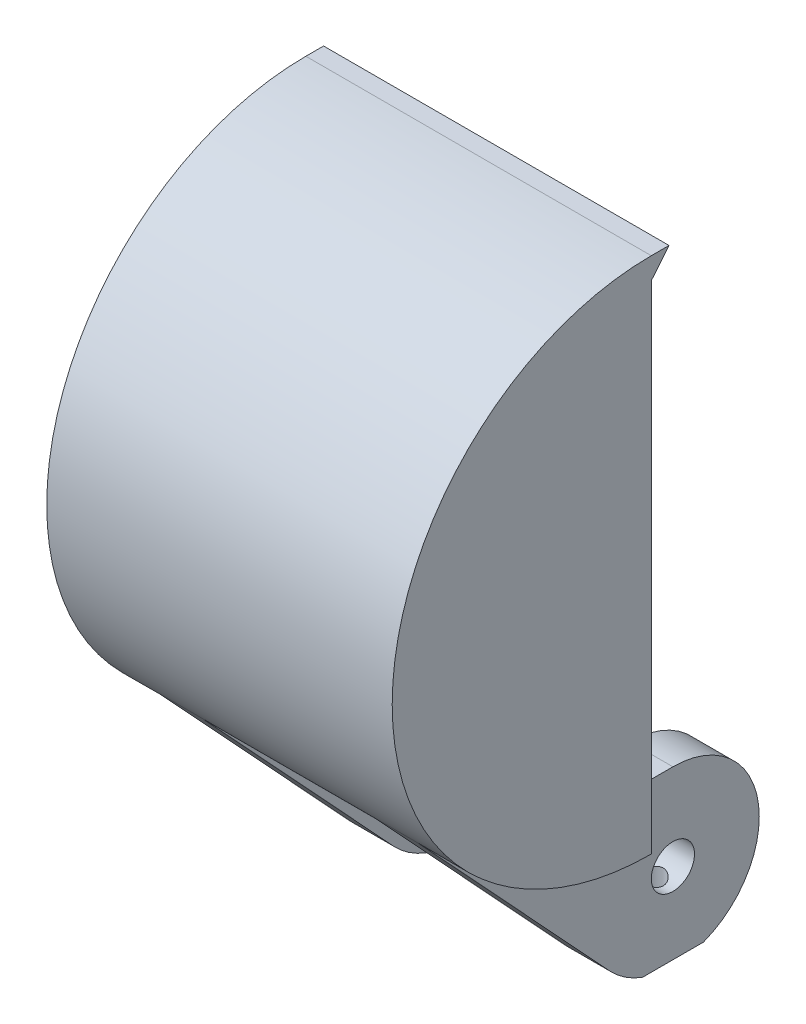
ISO-10303-21;
HEADER;
FILE_DESCRIPTION(('STEP AP214'),'2;1');
FILE_NAME('part.step','',(''),(''),'','','');
FILE_SCHEMA(('AUTOMOTIVE_DESIGN { 1 0 10303 214 1 1 1 1 }'));
ENDSEC;
DATA;
#1=APPLICATION_CONTEXT('core data for automotive mechanical design processes');
#2=APPLICATION_PROTOCOL_DEFINITION('international standard','automotive_design',2000,#1);
#3=PRODUCT_CONTEXT('',#1,'mechanical');
#4=PRODUCT('Part','Part','',(#3));
#5=PRODUCT_RELATED_PRODUCT_CATEGORY('part','',(#4));
#6=PRODUCT_DEFINITION_FORMATION('','',#4);
#7=PRODUCT_DEFINITION_CONTEXT('part definition',#1,'design');
#8=PRODUCT_DEFINITION('design','',#6,#7);
#9=PRODUCT_DEFINITION_SHAPE('','',#8);
#10=(LENGTH_UNIT() NAMED_UNIT(*) SI_UNIT(.MILLI.,.METRE.));
#11=(NAMED_UNIT(*) PLANE_ANGLE_UNIT() SI_UNIT($,.RADIAN.));
#12=(NAMED_UNIT(*) SI_UNIT($,.STERADIAN.) SOLID_ANGLE_UNIT());
#13=UNCERTAINTY_MEASURE_WITH_UNIT(LENGTH_MEASURE(1.E-05),#10,'distance_accuracy_value','');
#14=(GEOMETRIC_REPRESENTATION_CONTEXT(3) GLOBAL_UNCERTAINTY_ASSIGNED_CONTEXT((#13)) GLOBAL_UNIT_ASSIGNED_CONTEXT((#10,
#11,#12)) REPRESENTATION_CONTEXT('',''));
#15=CARTESIAN_POINT('',(0.,0.,0.));
#16=DIRECTION('',(0.,0.,1.));
#17=DIRECTION('',(1.,0.,0.));
#18=AXIS2_PLACEMENT_3D('',#15,#16,#17);
#19=CARTESIAN_POINT('',(19.05,-9.525,-9.5249999999999));
#20=DIRECTION('',(-1.,0.,0.));
#21=DIRECTION('',(0.,0.,1.));
#22=AXIS2_PLACEMENT_3D('',#19,#20,#21);
#23=CYLINDRICAL_SURFACE('',#22,12.7);
#24=CARTESIAN_POINT('',(-12.7,-9.525,-9.5249999999999));
#25=DIRECTION('',(1.,0.,0.));
#26=DIRECTION('',(0.,0.,-1.));
#27=AXIS2_PLACEMENT_3D('',#24,#25,#26);
#28=CIRCLE('',#27,12.7);
#29=CARTESIAN_POINT('',(-12.7,-21.4047622030073,-14.0151280605345));
#30=VERTEX_POINT('',#29);
#31=CARTESIAN_POINT('',(-12.7,3.17499999999999,-9.5249999999999));
#32=VERTEX_POINT('',#31);
#33=EDGE_CURVE('E284',#30,#32,#28,.T.);
#34=ORIENTED_EDGE('',*,*,#33,.F.);
#35=DIRECTION('',(-1.,0.,0.));
#36=VECTOR('',#35,1.);
#37=CARTESIAN_POINT('',(19.05,-21.4047622030073,-14.0151280605345));
#38=LINE('',#37,#36);
#39=CARTESIAN_POINT('',(-19.05,-21.4047622030073,-14.0151280605345));
#40=VERTEX_POINT('',#39);
#41=EDGE_CURVE('E59',#30,#40,#38,.T.);
#42=ORIENTED_EDGE('',*,*,#41,.T.);
#43=CARTESIAN_POINT('',(-19.05,-9.525,-9.5249999999999));
#44=DIRECTION('',(1.,0.,0.));
#45=DIRECTION('',(0.,0.,-1.));
#46=AXIS2_PLACEMENT_3D('',#43,#44,#45);
#47=CIRCLE('',#46,12.7);
#48=CARTESIAN_POINT('',(-19.05,3.17499999999999,-9.52499999999991));
#49=VERTEX_POINT('',#48);
#50=EDGE_CURVE('E232',#40,#49,#47,.T.);
#51=ORIENTED_EDGE('',*,*,#50,.T.);
#52=DIRECTION('',(-1.,0.,0.));
#53=VECTOR('',#52,1.);
#54=CARTESIAN_POINT('',(19.05,3.17499999999999,-9.5249999999999));
#55=LINE('',#54,#53);
#56=EDGE_CURVE('E240',#32,#49,#55,.T.);
#57=ORIENTED_EDGE('',*,*,#56,.F.);
#58=EDGE_LOOP('',(#34,#42,#51,#57));
#59=FACE_BOUND('',#58,.T.);
#60=ADVANCED_FACE('F41',(#59),#23,.T.);
#61=DIRECTION('',(-1.,0.,0.));
#62=VECTOR('',#61,1.);
#63=CARTESIAN_POINT('',(19.05,-21.4047622030073,-5.03487193946534));
#64=LINE('',#63,#62);
#65=CARTESIAN_POINT('',(19.05,-21.4047622030073,-5.03487193946534));
#66=VERTEX_POINT('',#65);
#67=CARTESIAN_POINT('',(12.7,-21.4047622030073,-5.03487193946534));
#68=VERTEX_POINT('',#67);
#69=EDGE_CURVE('E67',#66,#68,#64,.T.);
#70=ORIENTED_EDGE('',*,*,#69,.F.);
#71=CARTESIAN_POINT('',(19.05,-9.525,-9.5249999999999));
#72=DIRECTION('',(1.,0.,0.));
#73=DIRECTION('',(0.,0.,-1.));
#74=AXIS2_PLACEMENT_3D('',#71,#72,#73);
#75=CIRCLE('',#74,12.7);
#76=CARTESIAN_POINT('',(19.05,-18.1607402704121,-0.212965314605844));
#77=VERTEX_POINT('',#76);
#78=EDGE_CURVE('E206',#77,#66,#75,.T.);
#79=ORIENTED_EDGE('',*,*,#78,.F.);
#80=DIRECTION('',(1.,0.,0.));
#81=VECTOR('',#80,1.);
#82=CARTESIAN_POINT('',(-67.3789528206499,-18.1607402704121,-0.212965314605844));
#83=LINE('',#82,#81);
#84=CARTESIAN_POINT('',(12.7,-18.1607402704121,-0.212965314605844));
#85=VERTEX_POINT('',#84);
#86=EDGE_CURVE('E548',#85,#77,#83,.T.);
#87=ORIENTED_EDGE('',*,*,#86,.F.);
#88=CARTESIAN_POINT('',(12.7,-9.525,-9.5249999999999));
#89=DIRECTION('',(1.,0.,0.));
#90=DIRECTION('',(0.,0.,-1.));
#91=AXIS2_PLACEMENT_3D('',#88,#89,#90);
#92=CIRCLE('',#91,12.7);
#93=EDGE_CURVE('E208',#85,#68,#92,.T.);
#94=ORIENTED_EDGE('',*,*,#93,.T.);
#95=EDGE_LOOP('',(#70,#79,#87,#94));
#96=FACE_BOUND('',#95,.T.);
#97=ADVANCED_FACE('F204',(#96),#23,.T.);
#98=DIRECTION('',(-1.,0.,0.));
#99=VECTOR('',#98,1.);
#100=CARTESIAN_POINT('',(19.05,-21.4047622030073,-14.0151280605345));
#101=LINE('',#100,#99);
#102=CARTESIAN_POINT('',(12.7,-21.4047622030073,-14.0151280605345));
#103=VERTEX_POINT('',#102);
#104=CARTESIAN_POINT('',(19.05,-21.4047622030073,-14.0151280605345));
#105=VERTEX_POINT('',#104);
#106=EDGE_CURVE('E193',#103,#105,#101,.F.);
#107=ORIENTED_EDGE('',*,*,#106,.F.);
#108=CARTESIAN_POINT('',(12.7,3.17499999999999,-9.5249999999999));
#109=VERTEX_POINT('',#108);
#110=EDGE_CURVE('E564',#103,#109,#92,.T.);
#111=ORIENTED_EDGE('',*,*,#110,.T.);
#112=CARTESIAN_POINT('',(19.05,3.17499999999999,-9.5249999999999));
#113=VERTEX_POINT('',#112);
#114=EDGE_CURVE('E245',#113,#109,#55,.T.);
#115=ORIENTED_EDGE('',*,*,#114,.F.);
#116=EDGE_CURVE('E218',#105,#113,#75,.T.);
#117=ORIENTED_EDGE('',*,*,#116,.F.);
#118=EDGE_LOOP('',(#107,#111,#115,#117));
#119=FACE_BOUND('',#118,.T.);
#120=ADVANCED_FACE('F407',(#119),#23,.T.);
#121=CARTESIAN_POINT('',(19.05,-9.525,-9.5249999999999));
#122=DIRECTION('',(1.,0.,0.));
#123=DIRECTION('',(0.,0.,-1.));
#124=AXIS2_PLACEMENT_3D('',#121,#122,#123);
#125=PLANE('',#124);
#126=CARTESIAN_POINT('',(19.05,-9.525,-9.5249999999999));
#127=DIRECTION('',(1.,0.,0.));
#128=DIRECTION('',(0.,0.,-1.));
#129=AXIS2_PLACEMENT_3D('',#126,#127,#128);
#130=CIRCLE('',#129,3.175);
#131=CARTESIAN_POINT('',(19.05,-9.525,-12.6999999999999));
#132=VERTEX_POINT('',#131);
#133=EDGE_CURVE('E295',#132,#132,#130,.F.);
#134=ORIENTED_EDGE('',*,*,#133,.T.);
#135=EDGE_LOOP('',(#134));
#136=FACE_BOUND('',#135,.T.);
#137=ORIENTED_EDGE('',*,*,#78,.T.);
#138=DIRECTION('',(0.,0.,-1.));
#139=VECTOR('',#138,1.);
#140=CARTESIAN_POINT('',(19.05,-21.4047622030073,-15.8749999999999));
#141=LINE('',#140,#139);
#142=EDGE_CURVE('E190',#66,#105,#141,.T.);
#143=ORIENTED_EDGE('',*,*,#142,.T.);
#144=ORIENTED_EDGE('',*,*,#116,.T.);
#145=DIRECTION('',(0.,0.,1.));
#146=VECTOR('',#145,1.);
#147=CARTESIAN_POINT('',(19.05,3.175,0.));
#148=LINE('',#147,#146);
#149=CARTESIAN_POINT('',(19.05,3.175,0.));
#150=VERTEX_POINT('',#149);
#151=EDGE_CURVE('E233',#113,#150,#148,.T.);
#152=ORIENTED_EDGE('',*,*,#151,.T.);
#153=DIRECTION('',(0.,-1.,0.));
#154=VECTOR('',#153,1.);
#155=CARTESIAN_POINT('',(19.05,3.175,0.));
#156=LINE('',#155,#154);
#157=CARTESIAN_POINT('',(19.05,0.,0.));
#158=VERTEX_POINT('',#157);
#159=EDGE_CURVE('E237',#150,#158,#156,.T.);
#160=ORIENTED_EDGE('',*,*,#159,.T.);
#161=CARTESIAN_POINT('',(19.05,38.1,0.));
#162=DIRECTION('',(1.,0.,0.));
#163=DIRECTION('',(0.,0.,-1.));
#164=AXIS2_PLACEMENT_3D('',#161,#162,#163);
#165=CIRCLE('',#164,38.1);
#166=CARTESIAN_POINT('',(19.05,12.1927791887636,27.9361040561822));
#167=VERTEX_POINT('',#166);
#168=EDGE_CURVE('E540',#167,#158,#165,.T.);
#169=ORIENTED_EDGE('',*,*,#168,.F.);
#170=DIRECTION('',(0.,-0.733231077590084,-0.679979548851349));
#171=VECTOR('',#170,1.);
#172=CARTESIAN_POINT('',(19.05,12.1927791887636,27.9361040561822));
#173=LINE('',#172,#171);
#174=EDGE_CURVE('E215',#167,#77,#173,.T.);
#175=ORIENTED_EDGE('',*,*,#174,.T.);
#176=EDGE_LOOP('',(#137,#143,#144,#152,#160,#169,#175));
#177=FACE_BOUND('',#176,.T.);
#178=ADVANCED_FACE('F212',(#136,#177),#125,.T.);
#179=CARTESIAN_POINT('',(12.7,-9.525,-9.5249999999999));
#180=DIRECTION('',(1.,0.,0.));
#181=DIRECTION('',(0.,0.,-1.));
#182=AXIS2_PLACEMENT_3D('',#179,#180,#181);
#183=PLANE('',#182);
#184=CARTESIAN_POINT('',(12.7,-9.525,-9.5249999999999));
#185=DIRECTION('',(1.,0.,0.));
#186=DIRECTION('',(0.,0.,-1.));
#187=AXIS2_PLACEMENT_3D('',#184,#185,#186);
#188=CIRCLE('',#187,3.175);
#189=CARTESIAN_POINT('',(12.7,-9.525,-12.6999999999999));
#190=VERTEX_POINT('',#189);
#191=EDGE_CURVE('E290',#190,#190,#188,.T.);
#192=ORIENTED_EDGE('',*,*,#191,.T.);
#193=EDGE_LOOP('',(#192));
#194=FACE_BOUND('',#193,.T.);
#195=DIRECTION('',(0.,0.,1.));
#196=VECTOR('',#195,1.);
#197=CARTESIAN_POINT('',(12.7,-21.4047622030073,-10.3976842566553));
#198=LINE('',#197,#196);
#199=EDGE_CURVE('E198',#103,#68,#198,.T.);
#200=ORIENTED_EDGE('',*,*,#199,.T.);
#201=ORIENTED_EDGE('',*,*,#93,.F.);
#202=DIRECTION('',(0.,-0.733231077590084,-0.679979548851349));
#203=VECTOR('',#202,1.);
#204=CARTESIAN_POINT('',(12.7,12.1927791887636,27.9361040561822));
#205=LINE('',#204,#203);
#206=CARTESIAN_POINT('',(12.7,12.1927791887636,27.9361040561822));
#207=VERTEX_POINT('',#206);
#208=EDGE_CURVE('E507',#207,#85,#205,.T.);
#209=ORIENTED_EDGE('',*,*,#208,.F.);
#210=CARTESIAN_POINT('',(12.7,38.1,0.));
#211=DIRECTION('',(-1.,0.,0.));
#212=DIRECTION('',(0.,0.,-1.));
#213=AXIS2_PLACEMENT_3D('',#210,#211,#212);
#214=CIRCLE('',#213,38.1);
#215=CARTESIAN_POINT('',(12.7,0.,0.));
#216=VERTEX_POINT('',#215);
#217=EDGE_CURVE('E525',#216,#207,#214,.T.);
#218=ORIENTED_EDGE('',*,*,#217,.F.);
#219=DIRECTION('',(0.,-1.,0.));
#220=VECTOR('',#219,1.);
#221=CARTESIAN_POINT('',(12.7,3.175,0.));
#222=LINE('',#221,#220);
#223=CARTESIAN_POINT('',(12.7,3.175,0.));
#224=VERTEX_POINT('',#223);
#225=EDGE_CURVE('E521',#224,#216,#222,.T.);
#226=ORIENTED_EDGE('',*,*,#225,.F.);
#227=DIRECTION('',(0.,0.,1.));
#228=VECTOR('',#227,1.);
#229=CARTESIAN_POINT('',(12.7,3.17499999999999,-9.5249999999999));
#230=LINE('',#229,#228);
#231=EDGE_CURVE('E500',#109,#224,#230,.T.);
#232=ORIENTED_EDGE('',*,*,#231,.F.);
#233=ORIENTED_EDGE('',*,*,#110,.F.);
#234=EDGE_LOOP('',(#200,#201,#209,#218,#226,#232,#233));
#235=FACE_BOUND('',#234,.T.);
#236=ADVANCED_FACE('F396',(#194,#235),#183,.F.);
#237=CARTESIAN_POINT('',(15.875,76.201,-9.5249999999999));
#238=DIRECTION('',(0.,-1.,0.));
#239=DIRECTION('',(0.,0.,-1.));
#240=AXIS2_PLACEMENT_3D('',#237,#238,#239);
#241=CYLINDRICAL_SURFACE('',#240,1.7526);
#242=CARTESIAN_POINT('',(15.875,-12.1724550496656,-11.2775999999999));
#243=CARTESIAN_POINT('',(15.9647567687844,-12.1724645583195,-11.2775932057311));
#244=CARTESIAN_POINT('',(16.0545904624648,-12.1770919527004,-11.270656874895));
#245=CARTESIAN_POINT('',(16.2313732835301,-12.1948747829699,-11.2433249380897));
#246=CARTESIAN_POINT('',(16.3183173365313,-12.208044465479,-11.2229068465438));
#247=CARTESIAN_POINT('',(16.4864084189323,-12.2408924027287,-11.1698436469183));
#248=CARTESIAN_POINT('',(16.5675881047478,-12.2605297174707,-11.137275281995));
#249=CARTESIAN_POINT('',(16.7232996676529,-12.3040335545495,-11.0610722078565));
#250=CARTESIAN_POINT('',(16.7978301212098,-12.3279009792585,-11.0174351365931));
#251=CARTESIAN_POINT('',(16.9464815816065,-12.3801292164263,-10.9151373616518));
#252=CARTESIAN_POINT('',(17.01978750351,-12.4087000877072,-10.8553990696575));
#253=CARTESIAN_POINT('',(17.1559950270638,-12.4654302207083,-10.7248195296341));
#254=CARTESIAN_POINT('',(17.218890346704,-12.4935892246236,-10.6539716276405));
#255=CARTESIAN_POINT('',(17.3378586401947,-12.5492309309299,-10.4957077133186));
#256=CARTESIAN_POINT('',(17.392867879543,-12.5764434991874,-10.4073879322698));
#257=CARTESIAN_POINT('',(17.4868673418205,-12.6242731681391,-10.2209607365159));
#258=CARTESIAN_POINT('',(17.5258698599881,-12.6448953284168,-10.1228609064251));
#259=CARTESIAN_POINT('',(17.5833106874674,-12.6756837546072,-9.92834416413666));
#260=CARTESIAN_POINT('',(17.6031964684274,-12.6865804503802,-9.83247311008537));
#261=CARTESIAN_POINT('',(17.6266696742046,-12.6994704759873,-9.63819148065581));
#262=CARTESIAN_POINT('',(17.6302695655729,-12.7014706159527,-9.53978290575991));
#263=CARTESIAN_POINT('',(17.6214789917252,-12.6966246786264,-9.35437283363614));
#264=CARTESIAN_POINT('',(17.6107347232989,-12.6906892179928,-9.26726276078522));
#265=CARTESIAN_POINT('',(17.5765972895375,-12.672101316059,-9.09631486651102));
#266=CARTESIAN_POINT('',(17.5532031515392,-12.6594483582442,-9.01247729724586));
#267=CARTESIAN_POINT('',(17.4944382491126,-12.6283807306155,-8.84925118362467));
#268=CARTESIAN_POINT('',(17.4589431028748,-12.6099063805235,-8.76991925045296));
#269=CARTESIAN_POINT('',(17.3772405545183,-12.5687641546071,-8.61818500137319));
#270=CARTESIAN_POINT('',(17.3310297477191,-12.5460949464164,-8.54578489826318));
#271=CARTESIAN_POINT('',(17.2235075829806,-12.4956892715234,-8.40157792939114));
#272=CARTESIAN_POINT('',(17.1611025549059,-12.4676698967392,-8.33068538594523));
#273=CARTESIAN_POINT('',(17.0258266949111,-12.4111118915545,-8.19982996556361));
#274=CARTESIAN_POINT('',(16.9529449908922,-12.3825727489744,-8.13987859127766));
#275=CARTESIAN_POINT('',(16.7909889660955,-12.3253247656826,-8.02728873424891));
#276=CARTESIAN_POINT('',(16.7010513038562,-12.2968261129468,-7.97577316179563));
#277=CARTESIAN_POINT('',(16.511959017779,-12.2464854609558,-7.88894382045943));
#278=CARTESIAN_POINT('',(16.4128152219245,-12.2246357676412,-7.85361130071953));
#279=CARTESIAN_POINT('',(16.2163401773019,-12.1927580505862,-7.80322097707649));
#280=CARTESIAN_POINT('',(16.119508124948,-12.1819184333054,-7.78675731583384));
#281=CARTESIAN_POINT('',(15.9238974176234,-12.1711146297793,-7.77034413298263));
#282=CARTESIAN_POINT('',(15.8251211685018,-12.171137755236,-7.77037534443508));
#283=CARTESIAN_POINT('',(15.6440385531217,-12.1811971970573,-7.7856648646544));
#284=CARTESIAN_POINT('',(15.5614445974087,-12.1897618504179,-7.7986852953054));
#285=CARTESIAN_POINT('',(15.3998477283674,-12.2135672776657,-7.8360010665742));
#286=CARTESIAN_POINT('',(15.3208464311007,-12.2288110238097,-7.86030142714959));
#287=CARTESIAN_POINT('',(15.1648173172754,-12.2649568013238,-7.92046422883784));
#288=CARTESIAN_POINT('',(15.0880103435855,-12.2860688765406,-7.95676785856972));
#289=CARTESIAN_POINT('',(14.9411177888474,-12.3314685447584,-8.03954141333379));
#290=CARTESIAN_POINT('',(14.8710355423953,-12.3557576992175,-8.08601634492685));
#291=CARTESIAN_POINT('',(14.7278381600453,-12.4094255284405,-8.19644663562287));
#292=CARTESIAN_POINT('',(14.6560284637572,-12.4389971945228,-8.26200864536626));
#293=CARTESIAN_POINT('',(14.5239033862796,-12.496690808326,-8.40446943350483));
#294=CARTESIAN_POINT('',(14.4635948749868,-12.5248118823083,-8.48137493927502));
#295=CARTESIAN_POINT('',(14.3532843358461,-12.5782257387154,-8.64944447337316));
#296=CARTESIAN_POINT('',(14.3039767512683,-12.6032969952058,-8.74114025981718));
#297=CARTESIAN_POINT('',(14.2220114702828,-12.6459227076068,-8.93329616434359));
#298=CARTESIAN_POINT('',(14.1893363673381,-12.6634850188253,-9.0337469904128));
#299=CARTESIAN_POINT('',(14.1448786601393,-12.6875986147374,-9.22951552046447));
#300=CARTESIAN_POINT('',(14.1313026872026,-12.6950914992254,-9.32430924154136));
#301=CARTESIAN_POINT('',(14.1198284437919,-12.7014159125461,-9.51511133822979));
#302=CARTESIAN_POINT('',(14.1219217794707,-12.7002520786736,-9.61111903601493));
#303=CARTESIAN_POINT('',(14.1407398084891,-12.6899056611602,-9.79239124808271));
#304=CARTESIAN_POINT('',(14.1561252727485,-12.6814571805016,-9.87784259935055));
#305=CARTESIAN_POINT('',(14.1990219186543,-12.6583042261247,-10.0447406050672));
#306=CARTESIAN_POINT('',(14.2265345370975,-12.6435990111304,-10.1261867837212));
#307=CARTESIAN_POINT('',(14.2937483962366,-12.6085896707191,-10.2859304255072));
#308=CARTESIAN_POINT('',(14.3338292808446,-12.5881135032197,-10.3640291680029));
#309=CARTESIAN_POINT('',(14.4245681351635,-12.5434783100661,-10.5126456870434));
#310=CARTESIAN_POINT('',(14.4752303439618,-12.5193178094454,-10.5831604080751));
#311=CARTESIAN_POINT('',(14.5923990849817,-12.4662656720876,-10.7232559758487));
#312=CARTESIAN_POINT('',(14.6600598508985,-12.4371499087476,-10.7917880228973));
#313=CARTESIAN_POINT('',(14.8058667733511,-12.3793970781111,-10.9170530540174));
#314=CARTESIAN_POINT('',(14.8840256538752,-12.3507606398921,-10.9737715035235));
#315=CARTESIAN_POINT('',(15.0551748343657,-12.2952235540166,-11.0774741882756));
#316=CARTESIAN_POINT('',(15.1488119712627,-12.2685729631375,-11.1235354453692));
#317=CARTESIAN_POINT('',(15.3443870200599,-12.2234506542013,-11.1986012735643));
#318=CARTESIAN_POINT('',(15.4462973957865,-12.2049530232922,-11.2276599823592));
#319=CARTESIAN_POINT('',(15.6037911141482,-12.1857806313311,-11.2573395263411));
#320=CARTESIAN_POINT('',(15.6576216486912,-12.1808138578013,-11.2649179327179));
#321=CARTESIAN_POINT('',(15.7659586709785,-12.1741482313781,-11.2750501520016));
#322=CARTESIAN_POINT('',(15.8204651367116,-12.1724492723505,-11.2776041280955));
#323=CARTESIAN_POINT('',(15.875,-12.1724550496656,-11.2775999999999));
#324=B_SPLINE_CURVE_WITH_KNOTS('',3,(#242,#243,#244,#245,#246,#247,#248,#249,#250,#251,#252,
#253,#254,#255,#256,#257,#258,#259,#260,#261,#262,#263,#264,#265,#266,#267,#268,#269,#270,#271,
#272,#273,#274,#275,#276,#277,#278,#279,#280,#281,#282,#283,#284,#285,#286,#287,#288,#289,#290,
#291,#292,#293,#294,#295,#296,#297,#298,#299,#300,#301,#302,#303,#304,#305,#306,#307,#308,#309,
#310,#311,#312,#313,#314,#315,#316,#317,#318,#319,#320,#321,#322,#323),.UNSPECIFIED.,.T.,.F.,(4,
2,2,2,2,2,2,2,2,2,2,2,2,2,2,2,2,2,2,2,2,2,2,2,2,2,2,2,2,2,2,2,2,2,2,2,2,2,2,2,4),(0.,
0.269038648864508,0.538527151572856,0.806341569744072,1.07421318733752,1.36937177088417,
1.66470781606018,1.98564049827594,2.30632619907024,2.60018222876049,2.89381327892236,
3.15648009799081,3.4191671166853,3.68463994795934,3.95019724361247,4.24452910631171,
4.53916864495985,4.8599850106659,5.18042870904633,5.47501720880937,5.76926161339844,
6.02027487179393,6.2713999469989,6.53303133187411,6.79479178885285,7.09838795026176,
7.40216489182913,7.72165444713747,8.04080895324393,8.32735840738305,8.61375437165393,
8.8742706871395,9.13481787628699,9.40414886274312,9.67358795619315,9.97415122593313,
10.2750821299158,10.5964553832114,10.916799705918,11.0802688535257,11.2437326917836),.UNSPECIFIED.);
#325=CARTESIAN_POINT('',(15.875,-12.1724550496656,-11.2775999999999));
#326=VERTEX_POINT('',#325);
#327=EDGE_CURVE('E349',#326,#326,#324,.T.);
#328=ORIENTED_EDGE('',*,*,#327,.F.);
#329=EDGE_LOOP('',(#328));
#330=FACE_BOUND('',#329,.T.);
#331=CARTESIAN_POINT('',(15.875,-21.4047622030073,-9.5249999999999));
#332=DIRECTION('',(0.,-1.,0.));
#333=DIRECTION('',(0.,0.,-1.));
#334=AXIS2_PLACEMENT_3D('',#331,#332,#333);
#335=CIRCLE('',#334,1.7526);
#336=CARTESIAN_POINT('',(15.875,-21.4047622030073,-11.2775999999999));
#337=VERTEX_POINT('',#336);
#338=EDGE_CURVE('E324',#337,#337,#335,.T.);
#339=ORIENTED_EDGE('',*,*,#338,.T.);
#340=EDGE_LOOP('',(#339));
#341=FACE_BOUND('',#340,.T.);
#342=ADVANCED_FACE('F365',(#330,#341),#241,.F.);
#343=CARTESIAN_POINT('',(-19.05,-18.1607402704121,-0.212965314605847));
#344=VERTEX_POINT('',#343);
#345=CARTESIAN_POINT('',(-19.05,-21.4047622030073,-5.03487193946534));
#346=VERTEX_POINT('',#345);
#347=EDGE_CURVE('E225',#344,#346,#47,.T.);
#348=ORIENTED_EDGE('',*,*,#347,.T.);
#349=DIRECTION('',(-1.,0.,0.));
#350=VECTOR('',#349,1.);
#351=CARTESIAN_POINT('',(19.05,-21.4047622030073,-5.03487193946534));
#352=LINE('',#351,#350);
#353=CARTESIAN_POINT('',(-12.7,-21.4047622030073,-5.03487193946534));
#354=VERTEX_POINT('',#353);
#355=EDGE_CURVE('E342',#346,#354,#352,.F.);
#356=ORIENTED_EDGE('',*,*,#355,.T.);
#357=CARTESIAN_POINT('',(-12.7,-18.1607402704121,-0.212965314605837));
#358=VERTEX_POINT('',#357);
#359=EDGE_CURVE('E285',#358,#354,#28,.T.);
#360=ORIENTED_EDGE('',*,*,#359,.F.);
#361=EDGE_CURVE('E541',#344,#358,#83,.T.);
#362=ORIENTED_EDGE('',*,*,#361,.F.);
#363=EDGE_LOOP('',(#348,#356,#360,#362));
#364=FACE_BOUND('',#363,.T.);
#365=ADVANCED_FACE('F394',(#364),#23,.T.);
#366=CARTESIAN_POINT('',(28.0302561210691,-9.525,-9.5249999999999));
#367=DIRECTION('',(-1.,0.,0.));
#368=DIRECTION('',(0.,0.,1.));
#369=AXIS2_PLACEMENT_3D('',#366,#367,#368);
#370=CYLINDRICAL_SURFACE('',#369,3.175);
#371=ORIENTED_EDGE('',*,*,#133,.F.);
#372=EDGE_LOOP('',(#371));
#373=FACE_BOUND('',#372,.T.);
#374=ORIENTED_EDGE('',*,*,#191,.F.);
#375=EDGE_LOOP('',(#374));
#376=FACE_BOUND('',#375,.T.);
#377=ORIENTED_EDGE('',*,*,#327,.T.);
#378=EDGE_LOOP('',(#377));
#379=FACE_BOUND('',#378,.T.);
#380=ADVANCED_FACE('F390',(#373,#376,#379),#370,.F.);
#381=CARTESIAN_POINT('',(-12.7,-9.525,-9.5249999999999));
#382=DIRECTION('',(1.,0.,0.));
#383=DIRECTION('',(0.,0.,-1.));
#384=AXIS2_PLACEMENT_3D('',#381,#382,#383);
#385=CIRCLE('',#384,3.175);
#386=CARTESIAN_POINT('',(-12.7,-9.525,-12.6999999999999));
#387=VERTEX_POINT('',#386);
#388=EDGE_CURVE('E294',#387,#387,#385,.T.);
#389=ORIENTED_EDGE('',*,*,#388,.T.);
#390=EDGE_LOOP('',(#389));
#391=FACE_BOUND('',#390,.T.);
#392=CARTESIAN_POINT('',(-19.05,-9.525,-9.5249999999999));
#393=DIRECTION('',(-1.,0.,0.));
#394=DIRECTION('',(0.,0.,1.));
#395=AXIS2_PLACEMENT_3D('',#392,#393,#394);
#396=CIRCLE('',#395,3.175);
#397=CARTESIAN_POINT('',(-19.05,-9.525,-6.3499999999999));
#398=VERTEX_POINT('',#397);
#399=EDGE_CURVE('E556',#398,#398,#396,.T.);
#400=ORIENTED_EDGE('',*,*,#399,.T.);
#401=EDGE_LOOP('',(#400));
#402=FACE_BOUND('',#401,.T.);
#403=CARTESIAN_POINT('',(-15.875,-12.1724550496656,-11.2775999999999));
#404=CARTESIAN_POINT('',(-15.7852432312156,-12.1724645583195,-11.2775932057311));
#405=CARTESIAN_POINT('',(-15.6954095375352,-12.1770919527004,-11.270656874895));
#406=CARTESIAN_POINT('',(-15.5186267164699,-12.1948747829699,-11.2433249380898));
#407=CARTESIAN_POINT('',(-15.4316826634687,-12.208044465479,-11.2229068465438));
#408=CARTESIAN_POINT('',(-15.2635915810677,-12.2408924027287,-11.1698436469183));
#409=CARTESIAN_POINT('',(-15.1824118952522,-12.2605297174707,-11.137275281995));
#410=CARTESIAN_POINT('',(-15.0267003323471,-12.3040335545495,-11.0610722078565));
#411=CARTESIAN_POINT('',(-14.9521698787902,-12.3279009792585,-11.0174351365931));
#412=CARTESIAN_POINT('',(-14.8035184183935,-12.3801292164263,-10.9151373616518));
#413=CARTESIAN_POINT('',(-14.73021249649,-12.4087000877072,-10.8553990696575));
#414=CARTESIAN_POINT('',(-14.5940049729362,-12.4654302207083,-10.7248195296341));
#415=CARTESIAN_POINT('',(-14.531109653296,-12.4935892246236,-10.6539716276405));
#416=CARTESIAN_POINT('',(-14.4121413598053,-12.5492309309299,-10.4957077133186));
#417=CARTESIAN_POINT('',(-14.357132120457,-12.5764434991874,-10.4073879322698));
#418=CARTESIAN_POINT('',(-14.2631326581795,-12.6242731681391,-10.2209607365159));
#419=CARTESIAN_POINT('',(-14.2241301400119,-12.6448953284168,-10.1228609064251));
#420=CARTESIAN_POINT('',(-14.1666893125326,-12.6756837546072,-9.92834416413666));
#421=CARTESIAN_POINT('',(-14.1468035315726,-12.6865804503802,-9.83247311008537));
#422=CARTESIAN_POINT('',(-14.1233303257954,-12.6994704759873,-9.63819148065581));
#423=CARTESIAN_POINT('',(-14.1197304344271,-12.7014706159527,-9.53978290575991));
#424=CARTESIAN_POINT('',(-14.1285210082748,-12.6966246786264,-9.35437283363614));
#425=CARTESIAN_POINT('',(-14.1392652767011,-12.6906892179928,-9.26726276078522));
#426=CARTESIAN_POINT('',(-14.1734027104625,-12.672101316059,-9.09631486651102));
#427=CARTESIAN_POINT('',(-14.1967968484608,-12.6594483582442,-9.01247729724585));
#428=CARTESIAN_POINT('',(-14.2555617508874,-12.6283807306155,-8.84925118362467));
#429=CARTESIAN_POINT('',(-14.2910568971252,-12.6099063805235,-8.76991925045296));
#430=CARTESIAN_POINT('',(-14.3727594454817,-12.5687641546071,-8.61818500137319));
#431=CARTESIAN_POINT('',(-14.4189702522809,-12.5460949464164,-8.54578489826318));
#432=CARTESIAN_POINT('',(-14.5264924170194,-12.4956892715234,-8.40157792939114));
#433=CARTESIAN_POINT('',(-14.5888974450941,-12.4676698967392,-8.33068538594523));
#434=CARTESIAN_POINT('',(-14.7241733050889,-12.4111118915545,-8.19982996556361));
#435=CARTESIAN_POINT('',(-14.7970550091078,-12.3825727489744,-8.13987859127766));
#436=CARTESIAN_POINT('',(-14.9590110339045,-12.3253247656826,-8.02728873424891));
#437=CARTESIAN_POINT('',(-15.0489486961438,-12.2968261129468,-7.97577316179563));
#438=CARTESIAN_POINT('',(-15.238040982221,-12.2464854609558,-7.88894382045943));
#439=CARTESIAN_POINT('',(-15.3371847780755,-12.2246357676412,-7.85361130071953));
#440=CARTESIAN_POINT('',(-15.5336598226981,-12.1927580505862,-7.80322097707649));
#441=CARTESIAN_POINT('',(-15.630491875052,-12.1819184333054,-7.78675731583384));
#442=CARTESIAN_POINT('',(-15.8261025823766,-12.1711146297793,-7.77034413298263));
#443=CARTESIAN_POINT('',(-15.9248788314982,-12.171137755236,-7.77037534443508));
#444=CARTESIAN_POINT('',(-16.1059614468783,-12.1811971970573,-7.7856648646544));
#445=CARTESIAN_POINT('',(-16.1885554025913,-12.1897618504179,-7.7986852953054));
#446=CARTESIAN_POINT('',(-16.3501522716326,-12.2135672776657,-7.8360010665742));
#447=CARTESIAN_POINT('',(-16.4291535688993,-12.2288110238097,-7.86030142714959));
#448=CARTESIAN_POINT('',(-16.5851826827246,-12.2649568013238,-7.92046422883784));
#449=CARTESIAN_POINT('',(-16.6619896564145,-12.2860688765406,-7.95676785856973));
#450=CARTESIAN_POINT('',(-16.8088822111526,-12.3314685447584,-8.03954141333379));
#451=CARTESIAN_POINT('',(-16.8789644576047,-12.3557576992175,-8.08601634492685));
#452=CARTESIAN_POINT('',(-17.0221618399547,-12.4094255284405,-8.19644663562287));
#453=CARTESIAN_POINT('',(-17.0939715362428,-12.4389971945228,-8.26200864536626));
#454=CARTESIAN_POINT('',(-17.2260966137204,-12.496690808326,-8.40446943350483));
#455=CARTESIAN_POINT('',(-17.2864051250132,-12.5248118823083,-8.48137493927502));
#456=CARTESIAN_POINT('',(-17.3967156641539,-12.5782257387154,-8.64944447337316));
#457=CARTESIAN_POINT('',(-17.4460232487317,-12.6032969952058,-8.74114025981718));
#458=CARTESIAN_POINT('',(-17.5279885297172,-12.6459227076068,-8.93329616434359));
#459=CARTESIAN_POINT('',(-17.5606636326619,-12.6634850188253,-9.0337469904128));
#460=CARTESIAN_POINT('',(-17.6051213398607,-12.6875986147374,-9.22951552046448));
#461=CARTESIAN_POINT('',(-17.6186973127974,-12.6950914992254,-9.32430924154136));
#462=CARTESIAN_POINT('',(-17.6301715562081,-12.7014159125461,-9.5151113382298));
#463=CARTESIAN_POINT('',(-17.6280782205293,-12.7002520786736,-9.61111903601494));
#464=CARTESIAN_POINT('',(-17.6092601915109,-12.6899056611602,-9.79239124808272));
#465=CARTESIAN_POINT('',(-17.5938747272515,-12.6814571805016,-9.87784259935055));
#466=CARTESIAN_POINT('',(-17.5509780813457,-12.6583042261247,-10.0447406050672));
#467=CARTESIAN_POINT('',(-17.5234654629025,-12.6435990111304,-10.1261867837212));
#468=CARTESIAN_POINT('',(-17.4562516037634,-12.6085896707191,-10.2859304255073));
#469=CARTESIAN_POINT('',(-17.4161707191554,-12.5881135032197,-10.3640291680029));
#470=CARTESIAN_POINT('',(-17.3254318648365,-12.5434783100661,-10.5126456870434));
#471=CARTESIAN_POINT('',(-17.2747696560382,-12.5193178094454,-10.5831604080751));
#472=CARTESIAN_POINT('',(-17.1576009150183,-12.4662656720876,-10.7232559758487));
#473=CARTESIAN_POINT('',(-17.0899401491015,-12.4371499087476,-10.7917880228973));
#474=CARTESIAN_POINT('',(-16.9441332266489,-12.3793970781111,-10.9170530540174));
#475=CARTESIAN_POINT('',(-16.8659743461248,-12.3507606398921,-10.9737715035235));
#476=CARTESIAN_POINT('',(-16.6948251656343,-12.2952235540166,-11.0774741882756));
#477=CARTESIAN_POINT('',(-16.6011880287373,-12.2685729631375,-11.1235354453692));
#478=CARTESIAN_POINT('',(-16.4056129799401,-12.2234506542013,-11.1986012735643));
#479=CARTESIAN_POINT('',(-16.3037026042135,-12.2049530232922,-11.2276599823592));
#480=CARTESIAN_POINT('',(-16.1462088858518,-12.1857806313311,-11.2573395263411));
#481=CARTESIAN_POINT('',(-16.0923783513088,-12.1808138578013,-11.2649179327179));
#482=CARTESIAN_POINT('',(-15.9840413290215,-12.1741482313781,-11.2750501520016));
#483=CARTESIAN_POINT('',(-15.9295348632884,-12.1724492723505,-11.2776041280955));
#484=CARTESIAN_POINT('',(-15.875,-12.1724550496656,-11.2775999999999));
#485=B_SPLINE_CURVE_WITH_KNOTS('',3,(#403,#404,#405,#406,#407,#408,#409,#410,#411,#412,#413,
#414,#415,#416,#417,#418,#419,#420,#421,#422,#423,#424,#425,#426,#427,#428,#429,#430,#431,#432,
#433,#434,#435,#436,#437,#438,#439,#440,#441,#442,#443,#444,#445,#446,#447,#448,#449,#450,#451,
#452,#453,#454,#455,#456,#457,#458,#459,#460,#461,#462,#463,#464,#465,#466,#467,#468,#469,#470,
#471,#472,#473,#474,#475,#476,#477,#478,#479,#480,#481,#482,#483,#484),.UNSPECIFIED.,.T.,.F.,(4,
2,2,2,2,2,2,2,2,2,2,2,2,2,2,2,2,2,2,2,2,2,2,2,2,2,2,2,2,2,2,2,2,2,2,2,2,2,2,2,4),(0.,
0.269038648864503,0.538527151572856,0.80634156974407,1.07421318733752,1.36937177088417,
1.66470781606018,1.98564049827594,2.30632619907024,2.60018222876048,2.89381327892236,
3.15648009799081,3.4191671166853,3.68463994795934,3.95019724361247,4.2445291063117,
4.53916864495985,4.8599850106659,5.18042870904633,5.47501720880937,5.76926161339844,
6.02027487179393,6.2713999469989,6.53303133187411,6.79479178885285,7.09838795026176,
7.40216489182913,7.72165444713747,8.04080895324393,8.32735840738306,8.61375437165393,
8.8742706871395,9.13481787628699,9.40414886274312,9.67358795619315,9.97415122593313,
10.2750821299158,10.5964553832114,10.916799705918,11.0802688535257,11.2437326917836),.UNSPECIFIED.);
#486=CARTESIAN_POINT('',(-15.875,-12.1724550496656,-11.2775999999999));
#487=VERTEX_POINT('',#486);
#488=EDGE_CURVE('E348',#487,#487,#485,.T.);
#489=ORIENTED_EDGE('',*,*,#488,.T.);
#490=EDGE_LOOP('',(#489));
#491=FACE_BOUND('',#490,.T.);
#492=ADVANCED_FACE('F393',(#391,#402,#491),#370,.F.);
#493=CARTESIAN_POINT('',(25.4,0.,0.));
#494=DIRECTION('',(0.,0.,1.));
#495=DIRECTION('',(1.,0.,0.));
#496=AXIS2_PLACEMENT_3D('',#493,#494,#495);
#497=PLANE('',#496);
#498=DIRECTION('',(0.,1.,0.));
#499=VECTOR('',#498,1.);
#500=CARTESIAN_POINT('',(-25.4,0.,0.));
#501=LINE('',#500,#499);
#502=CARTESIAN_POINT('',(-25.4,0.,0.));
#503=VERTEX_POINT('',#502);
#504=CARTESIAN_POINT('',(-25.4,73.025,0.));
#505=VERTEX_POINT('',#504);
#506=EDGE_CURVE('E267',#503,#505,#501,.T.);
#507=ORIENTED_EDGE('',*,*,#506,.T.);
#508=DIRECTION('',(-1.,0.,0.));
#509=VECTOR('',#508,1.);
#510=CARTESIAN_POINT('',(25.4,73.025,0.));
#511=LINE('',#510,#509);
#512=CARTESIAN_POINT('',(-9.525,73.025,0.));
#513=VERTEX_POINT('',#512);
#514=EDGE_CURVE('E501',#513,#505,#511,.T.);
#515=ORIENTED_EDGE('',*,*,#514,.F.);
#516=CARTESIAN_POINT('',(-9.525,60.325,0.));
#517=DIRECTION('',(0.,0.,1.));
#518=DIRECTION('',(1.,0.,0.));
#519=AXIS2_PLACEMENT_3D('',#516,#517,#518);
#520=CIRCLE('',#519,12.7);
#521=CARTESIAN_POINT('',(-22.225,60.325,0.));
#522=VERTEX_POINT('',#521);
#523=EDGE_CURVE('E320',#513,#522,#520,.T.);
#524=ORIENTED_EDGE('',*,*,#523,.T.);
#525=DIRECTION('',(0.,1.,0.));
#526=VECTOR('',#525,1.);
#527=CARTESIAN_POINT('',(-22.225,0.,0.));
#528=LINE('',#527,#526);
#529=CARTESIAN_POINT('',(-22.225,15.875,0.));
#530=VERTEX_POINT('',#529);
#531=EDGE_CURVE('E249',#530,#522,#528,.T.);
#532=ORIENTED_EDGE('',*,*,#531,.F.);
#533=CARTESIAN_POINT('',(-9.525,15.875,0.));
#534=DIRECTION('',(0.,0.,1.));
#535=DIRECTION('',(0.,-1.,0.));
#536=AXIS2_PLACEMENT_3D('',#533,#534,#535);
#537=CIRCLE('',#536,12.7);
#538=CARTESIAN_POINT('',(-9.525,3.175,0.));
#539=VERTEX_POINT('',#538);
#540=EDGE_CURVE('E317',#530,#539,#537,.T.);
#541=ORIENTED_EDGE('',*,*,#540,.T.);
#542=DIRECTION('',(1.,0.,0.));
#543=VECTOR('',#542,1.);
#544=CARTESIAN_POINT('',(-12.7,3.175,0.));
#545=LINE('',#544,#543);
#546=CARTESIAN_POINT('',(9.52500148441498,3.175,0.));
#547=VERTEX_POINT('',#546);
#548=EDGE_CURVE('E517',#539,#547,#545,.T.);
#549=ORIENTED_EDGE('',*,*,#548,.T.);
#550=CARTESIAN_POINT('',(9.525,15.875,0.));
#551=DIRECTION('',(0.,0.,1.));
#552=DIRECTION('',(1.,0.,0.));
#553=AXIS2_PLACEMENT_3D('',#550,#551,#552);
#554=CIRCLE('',#553,12.7);
#555=CARTESIAN_POINT('',(22.225,15.875,0.));
#556=VERTEX_POINT('',#555);
#557=EDGE_CURVE('E310',#547,#556,#554,.T.);
#558=ORIENTED_EDGE('',*,*,#557,.T.);
#559=DIRECTION('',(0.,1.,0.));
#560=VECTOR('',#559,1.);
#561=CARTESIAN_POINT('',(22.225,0.,0.));
#562=LINE('',#561,#560);
#563=CARTESIAN_POINT('',(22.225,60.325,0.));
#564=VERTEX_POINT('',#563);
#565=EDGE_CURVE('E253',#556,#564,#562,.T.);
#566=ORIENTED_EDGE('',*,*,#565,.T.);
#567=CARTESIAN_POINT('',(9.525,60.325,0.));
#568=DIRECTION('',(0.,0.,1.));
#569=DIRECTION('',(1.,0.,0.));
#570=AXIS2_PLACEMENT_3D('',#567,#568,#569);
#571=CIRCLE('',#570,12.7);
#572=CARTESIAN_POINT('',(9.525,73.025,0.));
#573=VERTEX_POINT('',#572);
#574=EDGE_CURVE('E313',#564,#573,#571,.T.);
#575=ORIENTED_EDGE('',*,*,#574,.T.);
#576=CARTESIAN_POINT('',(25.4,73.025,0.));
#577=VERTEX_POINT('',#576);
#578=EDGE_CURVE('E497',#577,#573,#511,.T.);
#579=ORIENTED_EDGE('',*,*,#578,.F.);
#580=DIRECTION('',(0.,1.,0.));
#581=VECTOR('',#580,1.);
#582=CARTESIAN_POINT('',(25.4,0.,0.));
#583=LINE('',#582,#581);
#584=CARTESIAN_POINT('',(25.4,0.,0.));
#585=VERTEX_POINT('',#584);
#586=EDGE_CURVE('E266',#585,#577,#583,.T.);
#587=ORIENTED_EDGE('',*,*,#586,.F.);
#588=DIRECTION('',(-1.,0.,0.));
#589=VECTOR('',#588,1.);
#590=CARTESIAN_POINT('',(25.4,0.,0.));
#591=LINE('',#590,#589);
#592=EDGE_CURVE('E280',#585,#158,#591,.T.);
#593=ORIENTED_EDGE('',*,*,#592,.T.);
#594=ORIENTED_EDGE('',*,*,#159,.F.);
#595=DIRECTION('',(-1.,0.,0.));
#596=VECTOR('',#595,1.);
#597=CARTESIAN_POINT('',(19.05,3.175,0.));
#598=LINE('',#597,#596);
#599=EDGE_CURVE('E51',#150,#224,#598,.T.);
#600=ORIENTED_EDGE('',*,*,#599,.T.);
#601=ORIENTED_EDGE('',*,*,#225,.T.);
#602=DIRECTION('',(1.,0.,0.));
#603=VECTOR('',#602,1.);
#604=CARTESIAN_POINT('',(-12.7,0.,0.));
#605=LINE('',#604,#603);
#606=CARTESIAN_POINT('',(-12.7,0.,0.));
#607=VERTEX_POINT('',#606);
#608=EDGE_CURVE('E531',#607,#216,#605,.T.);
#609=ORIENTED_EDGE('',*,*,#608,.F.);
#610=DIRECTION('',(0.,-1.,0.));
#611=VECTOR('',#610,1.);
#612=CARTESIAN_POINT('',(-12.7,3.175,0.));
#613=LINE('',#612,#611);
#614=CARTESIAN_POINT('',(-12.7,3.175,0.));
#615=VERTEX_POINT('',#614);
#616=EDGE_CURVE('E506',#615,#607,#613,.T.);
#617=ORIENTED_EDGE('',*,*,#616,.F.);
#618=DIRECTION('',(1.,0.,0.));
#619=VECTOR('',#618,1.);
#620=CARTESIAN_POINT('',(25.4,3.175,0.));
#621=LINE('',#620,#619);
#622=CARTESIAN_POINT('',(-19.05,3.175,0.));
#623=VERTEX_POINT('',#622);
#624=EDGE_CURVE('E11',#623,#615,#621,.T.);
#625=ORIENTED_EDGE('',*,*,#624,.F.);
#626=DIRECTION('',(0.,-1.,0.));
#627=VECTOR('',#626,1.);
#628=CARTESIAN_POINT('',(-19.05,3.175,0.));
#629=LINE('',#628,#627);
#630=CARTESIAN_POINT('',(-19.05,0.,0.));
#631=VERTEX_POINT('',#630);
#632=EDGE_CURVE('E223',#623,#631,#629,.T.);
#633=ORIENTED_EDGE('',*,*,#632,.T.);
#634=EDGE_CURVE('E279',#631,#503,#591,.T.);
#635=ORIENTED_EDGE('',*,*,#634,.T.);
#636=EDGE_LOOP('',(#507,#515,#524,#532,#541,#549,#558,#566,#575,#579,#587,#593,#594,#600,#601,
#609,#617,#625,#633,#635));
#637=FACE_BOUND('',#636,.T.);
#638=ADVANCED_FACE('F440',(#637),#497,.F.);
#639=CARTESIAN_POINT('',(19.05,3.175,0.));
#640=DIRECTION('',(0.,-1.,0.));
#641=DIRECTION('',(0.,0.,-1.));
#642=AXIS2_PLACEMENT_3D('',#639,#640,#641);
#643=PLANE('',#642);
#644=DIRECTION('',(0.,0.,1.));
#645=VECTOR('',#644,1.);
#646=CARTESIAN_POINT('',(-12.7,3.17499999999999,-9.5249999999999));
#647=LINE('',#646,#645);
#648=EDGE_CURVE('E471',#32,#615,#647,.T.);
#649=ORIENTED_EDGE('',*,*,#648,.F.);
#650=ORIENTED_EDGE('',*,*,#56,.T.);
#651=DIRECTION('',(0.,0.,1.));
#652=VECTOR('',#651,1.);
#653=CARTESIAN_POINT('',(-19.05,3.175,0.));
#654=LINE('',#653,#652);
#655=EDGE_CURVE('E217',#49,#623,#654,.T.);
#656=ORIENTED_EDGE('',*,*,#655,.T.);
#657=ORIENTED_EDGE('',*,*,#624,.T.);
#658=EDGE_LOOP('',(#649,#650,#656,#657));
#659=FACE_BOUND('',#658,.T.);
#660=ADVANCED_FACE('F419',(#659),#643,.F.);
#661=CARTESIAN_POINT('',(-67.3789528206499,12.1927791887636,27.9361040561822));
#662=DIRECTION('',(0.,-0.679979548851349,0.733231077590084));
#663=DIRECTION('',(0.,-0.733231077590084,-0.679979548851349));
#664=AXIS2_PLACEMENT_3D('',#661,#662,#663);
#665=PLANE('',#664);
#666=ORIENTED_EDGE('',*,*,#361,.T.);
#667=DIRECTION('',(0.,-0.733231077590084,-0.679979548851349));
#668=VECTOR('',#667,1.);
#669=CARTESIAN_POINT('',(-12.7,12.1927791887636,27.9361040561822));
#670=LINE('',#669,#668);
#671=CARTESIAN_POINT('',(-12.7,12.1927791887636,27.9361040561822));
#672=VERTEX_POINT('',#671);
#673=EDGE_CURVE('E514',#672,#358,#670,.T.);
#674=ORIENTED_EDGE('',*,*,#673,.F.);
#675=DIRECTION('',(1.,0.,0.));
#676=VECTOR('',#675,1.);
#677=CARTESIAN_POINT('',(-67.3789528206499,12.1927791887636,27.9361040561822));
#678=LINE('',#677,#676);
#679=CARTESIAN_POINT('',(-19.05,12.1927791887636,27.9361040561822));
#680=VERTEX_POINT('',#679);
#681=EDGE_CURVE('E549',#680,#672,#678,.T.);
#682=ORIENTED_EDGE('',*,*,#681,.F.);
#683=DIRECTION('',(0.,0.733231077590084,0.679979548851349));
#684=VECTOR('',#683,1.);
#685=CARTESIAN_POINT('',(-19.05,12.1927791887636,27.9361040561822));
#686=LINE('',#685,#684);
#687=EDGE_CURVE('E537',#344,#680,#686,.T.);
#688=ORIENTED_EDGE('',*,*,#687,.F.);
#689=EDGE_LOOP('',(#666,#674,#682,#688));
#690=FACE_BOUND('',#689,.T.);
#691=ADVANCED_FACE('F389',(#690),#665,.T.);
#692=CARTESIAN_POINT('',(25.4,38.1,0.));
#693=DIRECTION('',(-1.,0.,0.));
#694=DIRECTION('',(0.,0.,1.));
#695=AXIS2_PLACEMENT_3D('',#692,#693,#694);
#696=CYLINDRICAL_SURFACE('',#695,38.1);
#697=ORIENTED_EDGE('',*,*,#681,.T.);
#698=CARTESIAN_POINT('',(-12.7,38.1,0.));
#699=DIRECTION('',(-1.,0.,0.));
#700=DIRECTION('',(0.,0.,-1.));
#701=AXIS2_PLACEMENT_3D('',#698,#699,#700);
#702=CIRCLE('',#701,38.1);
#703=EDGE_CURVE('E511',#607,#672,#702,.T.);
#704=ORIENTED_EDGE('',*,*,#703,.F.);
#705=ORIENTED_EDGE('',*,*,#608,.T.);
#706=ORIENTED_EDGE('',*,*,#217,.T.);
#707=EDGE_CURVE('E544',#207,#167,#678,.T.);
#708=ORIENTED_EDGE('',*,*,#707,.T.);
#709=ORIENTED_EDGE('',*,*,#168,.T.);
#710=ORIENTED_EDGE('',*,*,#592,.F.);
#711=CARTESIAN_POINT('',(25.4,38.1,0.));
#712=DIRECTION('',(1.,0.,0.));
#713=DIRECTION('',(0.,0.,-1.));
#714=AXIS2_PLACEMENT_3D('',#711,#712,#713);
#715=CIRCLE('',#714,38.1);
#716=CARTESIAN_POINT('',(25.4,76.2,0.));
#717=VERTEX_POINT('',#716);
#718=EDGE_CURVE('E262',#717,#585,#715,.T.);
#719=ORIENTED_EDGE('',*,*,#718,.F.);
#720=DIRECTION('',(-1.,0.,0.));
#721=VECTOR('',#720,1.);
#722=CARTESIAN_POINT('',(25.4,76.2,0.));
#723=LINE('',#722,#721);
#724=CARTESIAN_POINT('',(-25.4,76.2,0.));
#725=VERTEX_POINT('',#724);
#726=EDGE_CURVE('E271',#717,#725,#723,.T.);
#727=ORIENTED_EDGE('',*,*,#726,.T.);
#728=CARTESIAN_POINT('',(-25.4,38.1,0.));
#729=DIRECTION('',(1.,0.,0.));
#730=DIRECTION('',(0.,0.,-1.));
#731=AXIS2_PLACEMENT_3D('',#728,#729,#730);
#732=CIRCLE('',#731,38.1);
#733=EDGE_CURVE('E258',#725,#503,#732,.T.);
#734=ORIENTED_EDGE('',*,*,#733,.T.);
#735=ORIENTED_EDGE('',*,*,#634,.F.);
#736=CARTESIAN_POINT('',(-19.05,38.1,0.));
#737=DIRECTION('',(1.,0.,0.));
#738=DIRECTION('',(0.,0.,-1.));
#739=AXIS2_PLACEMENT_3D('',#736,#737,#738);
#740=CIRCLE('',#739,38.1);
#741=EDGE_CURVE('E474',#680,#631,#740,.T.);
#742=ORIENTED_EDGE('',*,*,#741,.F.);
#743=EDGE_LOOP('',(#697,#704,#705,#706,#708,#709,#710,#719,#727,#734,#735,#742));
#744=FACE_BOUND('',#743,.T.);
#745=ADVANCED_FACE('F435',(#744),#696,.T.);
#746=CARTESIAN_POINT('',(25.4,38.1,0.));
#747=DIRECTION('',(1.,0.,0.));
#748=DIRECTION('',(0.,0.,-1.));
#749=AXIS2_PLACEMENT_3D('',#746,#747,#748);
#750=PLANE('',#749);
#751=ORIENTED_EDGE('',*,*,#718,.T.);
#752=ORIENTED_EDGE('',*,*,#586,.T.);
#753=DIRECTION('',(0.,-0.77251181991031,0.635000384329695));
#754=VECTOR('',#753,1.);
#755=CARTESIAN_POINT('',(25.4,76.2,-2.60983219710587));
#756=LINE('',#755,#754);
#757=CARTESIAN_POINT('',(25.4,76.2,-2.60983219710587));
#758=VERTEX_POINT('',#757);
#759=EDGE_CURVE('E495',#758,#577,#756,.T.);
#760=ORIENTED_EDGE('',*,*,#759,.F.);
#761=DIRECTION('',(0.,0.,-1.));
#762=VECTOR('',#761,1.);
#763=CARTESIAN_POINT('',(25.4,76.2,0.));
#764=LINE('',#763,#762);
#765=EDGE_CURVE('E492',#717,#758,#764,.T.);
#766=ORIENTED_EDGE('',*,*,#765,.F.);
#767=EDGE_LOOP('',(#751,#752,#760,#766));
#768=FACE_BOUND('',#767,.T.);
#769=ADVANCED_FACE('F432',(#768),#750,.T.);
#770=CARTESIAN_POINT('',(-25.4,38.1,0.));
#771=DIRECTION('',(1.,0.,0.));
#772=DIRECTION('',(0.,0.,-1.));
#773=AXIS2_PLACEMENT_3D('',#770,#771,#772);
#774=PLANE('',#773);
#775=ORIENTED_EDGE('',*,*,#733,.F.);
#776=DIRECTION('',(0.,0.,-1.));
#777=VECTOR('',#776,1.);
#778=CARTESIAN_POINT('',(-25.4,76.2,0.));
#779=LINE('',#778,#777);
#780=CARTESIAN_POINT('',(-25.4,76.2,-2.60983219710587));
#781=VERTEX_POINT('',#780);
#782=EDGE_CURVE('E358',#725,#781,#779,.T.);
#783=ORIENTED_EDGE('',*,*,#782,.T.);
#784=DIRECTION('',(0.,-0.77251181991031,0.635000384329695));
#785=VECTOR('',#784,1.);
#786=CARTESIAN_POINT('',(-25.4,76.2,-2.60983219710587));
#787=LINE('',#786,#785);
#788=EDGE_CURVE('E489',#781,#505,#787,.T.);
#789=ORIENTED_EDGE('',*,*,#788,.T.);
#790=ORIENTED_EDGE('',*,*,#506,.F.);
#791=EDGE_LOOP('',(#775,#783,#789,#790));
#792=FACE_BOUND('',#791,.T.);
#793=ADVANCED_FACE('F424',(#792),#774,.F.);
#794=CARTESIAN_POINT('',(25.4,38.1,0.));
#795=DIRECTION('',(-1.,0.,0.));
#796=DIRECTION('',(0.,0.,1.));
#797=AXIS2_PLACEMENT_3D('',#794,#795,#796);
#798=CYLINDRICAL_SURFACE('',#797,34.925);
#799=DIRECTION('',(-1.,0.,0.));
#800=VECTOR('',#799,1.);
#801=CARTESIAN_POINT('',(22.225,73.025,0.));
#802=LINE('',#801,#800);
#803=EDGE_CURVE('E254',#573,#513,#802,.T.);
#804=ORIENTED_EDGE('',*,*,#803,.F.);
#805=CARTESIAN_POINT('',(9.525,38.1,0.));
#806=DIRECTION('',(1.,0.,0.));
#807=DIRECTION('',(0.,0.,-1.));
#808=AXIS2_PLACEMENT_3D('',#805,#806,#807);
#809=CIRCLE('',#808,34.925);
#810=EDGE_CURVE('E299',#573,#547,#809,.T.);
#811=ORIENTED_EDGE('',*,*,#810,.T.);
#812=ORIENTED_EDGE('',*,*,#548,.F.);
#813=CARTESIAN_POINT('',(-9.525,38.1,0.));
#814=DIRECTION('',(1.,0.,0.));
#815=DIRECTION('',(0.,0.,-1.));
#816=AXIS2_PLACEMENT_3D('',#813,#814,#815);
#817=CIRCLE('',#816,34.925);
#818=EDGE_CURVE('E289',#539,#513,#817,.F.);
#819=ORIENTED_EDGE('',*,*,#818,.T.);
#820=EDGE_LOOP('',(#804,#811,#812,#819));
#821=FACE_BOUND('',#820,.T.);
#822=ADVANCED_FACE('F420',(#821),#798,.F.);
#823=CARTESIAN_POINT('',(22.225,38.1,0.));
#824=DIRECTION('',(1.,0.,0.));
#825=DIRECTION('',(0.,0.,-1.));
#826=AXIS2_PLACEMENT_3D('',#823,#824,#825);
#827=PLANE('',#826);
#828=ORIENTED_EDGE('',*,*,#565,.F.);
#829=CARTESIAN_POINT('',(22.225,38.1,0.));
#830=DIRECTION('',(1.,0.,0.));
#831=DIRECTION('',(0.,0.,-1.));
#832=AXIS2_PLACEMENT_3D('',#829,#830,#831);
#833=CIRCLE('',#832,22.225);
#834=EDGE_CURVE('E303',#556,#564,#833,.F.);
#835=ORIENTED_EDGE('',*,*,#834,.T.);
#836=EDGE_LOOP('',(#828,#835));
#837=FACE_BOUND('',#836,.T.);
#838=ADVANCED_FACE('F423',(#837),#827,.F.);
#839=CARTESIAN_POINT('',(-22.225,38.1,0.));
#840=DIRECTION('',(1.,0.,0.));
#841=DIRECTION('',(0.,0.,-1.));
#842=AXIS2_PLACEMENT_3D('',#839,#840,#841);
#843=PLANE('',#842);
#844=ORIENTED_EDGE('',*,*,#531,.T.);
#845=CARTESIAN_POINT('',(-22.225,38.1,0.));
#846=DIRECTION('',(1.,0.,0.));
#847=DIRECTION('',(0.,0.,-1.));
#848=AXIS2_PLACEMENT_3D('',#845,#846,#847);
#849=CIRCLE('',#848,22.225);
#850=EDGE_CURVE('E306',#522,#530,#849,.T.);
#851=ORIENTED_EDGE('',*,*,#850,.T.);
#852=EDGE_LOOP('',(#844,#851));
#853=FACE_BOUND('',#852,.T.);
#854=ADVANCED_FACE('F417',(#853),#843,.T.);
#855=ORIENTED_EDGE('',*,*,#114,.T.);
#856=ORIENTED_EDGE('',*,*,#231,.T.);
#857=ORIENTED_EDGE('',*,*,#599,.F.);
#858=ORIENTED_EDGE('',*,*,#151,.F.);
#859=EDGE_LOOP('',(#855,#856,#857,#858));
#860=FACE_BOUND('',#859,.T.);
#861=ADVANCED_FACE('F413',(#860),#643,.F.);
#862=CARTESIAN_POINT('',(-19.05,-9.525,-9.5249999999999));
#863=DIRECTION('',(1.,0.,0.));
#864=DIRECTION('',(0.,0.,-1.));
#865=AXIS2_PLACEMENT_3D('',#862,#863,#864);
#866=PLANE('',#865);
#867=ORIENTED_EDGE('',*,*,#50,.F.);
#868=DIRECTION('',(0.,0.,1.));
#869=VECTOR('',#868,1.);
#870=CARTESIAN_POINT('',(-19.05,-21.4047622030073,-15.8749999999999));
#871=LINE('',#870,#869);
#872=EDGE_CURVE('E336',#40,#346,#871,.T.);
#873=ORIENTED_EDGE('',*,*,#872,.T.);
#874=ORIENTED_EDGE('',*,*,#347,.F.);
#875=ORIENTED_EDGE('',*,*,#687,.T.);
#876=ORIENTED_EDGE('',*,*,#741,.T.);
#877=ORIENTED_EDGE('',*,*,#632,.F.);
#878=ORIENTED_EDGE('',*,*,#655,.F.);
#879=EDGE_LOOP('',(#867,#873,#874,#875,#876,#877,#878));
#880=FACE_BOUND('',#879,.T.);
#881=ORIENTED_EDGE('',*,*,#399,.F.);
#882=EDGE_LOOP('',(#881));
#883=FACE_BOUND('',#882,.T.);
#884=ADVANCED_FACE('F402',(#880,#883),#866,.F.);
#885=CARTESIAN_POINT('',(-12.7,-9.525,-9.5249999999999));
#886=DIRECTION('',(1.,0.,0.));
#887=DIRECTION('',(0.,0.,-1.));
#888=AXIS2_PLACEMENT_3D('',#885,#886,#887);
#889=PLANE('',#888);
#890=DIRECTION('',(0.,0.,-1.));
#891=VECTOR('',#890,1.);
#892=CARTESIAN_POINT('',(-12.7,-21.4047622030073,-15.8749999999999));
#893=LINE('',#892,#891);
#894=EDGE_CURVE('E199',#354,#30,#893,.T.);
#895=ORIENTED_EDGE('',*,*,#894,.T.);
#896=ORIENTED_EDGE('',*,*,#33,.T.);
#897=ORIENTED_EDGE('',*,*,#648,.T.);
#898=ORIENTED_EDGE('',*,*,#616,.T.);
#899=ORIENTED_EDGE('',*,*,#703,.T.);
#900=ORIENTED_EDGE('',*,*,#673,.T.);
#901=ORIENTED_EDGE('',*,*,#359,.T.);
#902=EDGE_LOOP('',(#895,#896,#897,#898,#899,#900,#901));
#903=FACE_BOUND('',#902,.T.);
#904=ORIENTED_EDGE('',*,*,#388,.F.);
#905=EDGE_LOOP('',(#904));
#906=FACE_BOUND('',#905,.T.);
#907=ADVANCED_FACE('F387',(#903,#906),#889,.T.);
#908=ORIENTED_EDGE('',*,*,#208,.T.);
#909=ORIENTED_EDGE('',*,*,#86,.T.);
#910=ORIENTED_EDGE('',*,*,#174,.F.);
#911=ORIENTED_EDGE('',*,*,#707,.F.);
#912=EDGE_LOOP('',(#908,#909,#910,#911));
#913=FACE_BOUND('',#912,.T.);
#914=ADVANCED_FACE('F383',(#913),#665,.T.);
#915=CARTESIAN_POINT('',(25.4,76.2,0.));
#916=DIRECTION('',(0.,1.,0.));
#917=DIRECTION('',(0.,0.,1.));
#918=AXIS2_PLACEMENT_3D('',#915,#916,#917);
#919=PLANE('',#918);
#920=ORIENTED_EDGE('',*,*,#782,.F.);
#921=ORIENTED_EDGE('',*,*,#726,.F.);
#922=ORIENTED_EDGE('',*,*,#765,.T.);
#923=DIRECTION('',(-1.,0.,0.));
#924=VECTOR('',#923,1.);
#925=CARTESIAN_POINT('',(25.4,76.2,-2.60983219710587));
#926=LINE('',#925,#924);
#927=EDGE_CURVE('E486',#758,#781,#926,.T.);
#928=ORIENTED_EDGE('',*,*,#927,.T.);
#929=EDGE_LOOP('',(#920,#921,#922,#928));
#930=FACE_BOUND('',#929,.T.);
#931=ADVANCED_FACE('F379',(#930),#919,.T.);
#932=CARTESIAN_POINT('',(25.4,76.2,-2.60983219710587));
#933=DIRECTION('',(0.,-0.635000384329695,-0.77251181991031));
#934=DIRECTION('',(0.,0.772511819910311,-0.635000384329695));
#935=AXIS2_PLACEMENT_3D('',#932,#933,#934);
#936=PLANE('',#935);
#937=ORIENTED_EDGE('',*,*,#788,.F.);
#938=ORIENTED_EDGE('',*,*,#927,.F.);
#939=ORIENTED_EDGE('',*,*,#759,.T.);
#940=ORIENTED_EDGE('',*,*,#578,.T.);
#941=ORIENTED_EDGE('',*,*,#803,.T.);
#942=ORIENTED_EDGE('',*,*,#514,.T.);
#943=EDGE_LOOP('',(#937,#938,#939,#940,#941,#942));
#944=FACE_BOUND('',#943,.T.);
#945=ADVANCED_FACE('F375',(#944),#936,.T.);
#946=CARTESIAN_POINT('',(9.525,38.1,0.));
#947=DIRECTION('',(1.,0.,0.));
#948=DIRECTION('',(0.,0.,-1.));
#949=AXIS2_PLACEMENT_3D('',#946,#947,#948);
#950=TOROIDAL_SURFACE('',#949,22.225,12.7);
#951=ORIENTED_EDGE('',*,*,#574,.F.);
#952=ORIENTED_EDGE('',*,*,#834,.F.);
#953=ORIENTED_EDGE('',*,*,#557,.F.);
#954=ORIENTED_EDGE('',*,*,#810,.F.);
#955=EDGE_LOOP('',(#951,#952,#953,#954));
#956=FACE_BOUND('',#955,.T.);
#957=ADVANCED_FACE('F378',(#956),#950,.F.);
#958=CARTESIAN_POINT('',(-9.525,38.1,0.));
#959=DIRECTION('',(1.,0.,0.));
#960=DIRECTION('',(0.,0.,-1.));
#961=AXIS2_PLACEMENT_3D('',#958,#959,#960);
#962=TOROIDAL_SURFACE('',#961,22.225,12.7);
#963=ORIENTED_EDGE('',*,*,#523,.F.);
#964=ORIENTED_EDGE('',*,*,#818,.F.);
#965=ORIENTED_EDGE('',*,*,#540,.F.);
#966=ORIENTED_EDGE('',*,*,#850,.F.);
#967=EDGE_LOOP('',(#963,#964,#965,#966));
#968=FACE_BOUND('',#967,.T.);
#969=ADVANCED_FACE('F43',(#968),#962,.F.);
#970=CARTESIAN_POINT('',(-15.875,76.201,-9.5249999999999));
#971=DIRECTION('',(0.,-1.,0.));
#972=DIRECTION('',(0.,0.,-1.));
#973=AXIS2_PLACEMENT_3D('',#970,#971,#972);
#974=CYLINDRICAL_SURFACE('',#973,1.7526);
#975=CARTESIAN_POINT('',(-15.875,-21.4047622030073,-9.5249999999999));
#976=DIRECTION('',(0.,1.,0.));
#977=DIRECTION('',(0.,0.,1.));
#978=AXIS2_PLACEMENT_3D('',#975,#976,#977);
#979=CIRCLE('',#978,1.7526);
#980=CARTESIAN_POINT('',(-15.875,-21.4047622030073,-7.7723999999999));
#981=VERTEX_POINT('',#980);
#982=EDGE_CURVE('E45',#981,#981,#979,.T.);
#983=ORIENTED_EDGE('',*,*,#982,.F.);
#984=EDGE_LOOP('',(#983));
#985=FACE_BOUND('',#984,.T.);
#986=ORIENTED_EDGE('',*,*,#488,.F.);
#987=EDGE_LOOP('',(#986));
#988=FACE_BOUND('',#987,.T.);
#989=ADVANCED_FACE('F370',(#985,#988),#974,.F.);
#990=CARTESIAN_POINT('',(0.,-21.4047622030073,0.));
#991=DIRECTION('',(0.,-1.,0.));
#992=DIRECTION('',(0.,0.,-1.));
#993=AXIS2_PLACEMENT_3D('',#990,#991,#992);
#994=PLANE('',#993);
#995=ORIENTED_EDGE('',*,*,#338,.F.);
#996=EDGE_LOOP('',(#995));
#997=FACE_BOUND('',#996,.T.);
#998=ORIENTED_EDGE('',*,*,#69,.T.);
#999=ORIENTED_EDGE('',*,*,#199,.F.);
#1000=ORIENTED_EDGE('',*,*,#106,.T.);
#1001=ORIENTED_EDGE('',*,*,#142,.F.);
#1002=EDGE_LOOP('',(#998,#999,#1000,#1001));
#1003=FACE_BOUND('',#1002,.T.);
#1004=ADVANCED_FACE('F191',(#997,#1003),#994,.T.);
#1005=CARTESIAN_POINT('',(0.,-21.4047622030073,0.));
#1006=DIRECTION('',(0.,1.,0.));
#1007=DIRECTION('',(0.,0.,1.));
#1008=AXIS2_PLACEMENT_3D('',#1005,#1006,#1007);
#1009=PLANE('',#1008);
#1010=ORIENTED_EDGE('',*,*,#982,.T.);
#1011=EDGE_LOOP('',(#1010));
#1012=FACE_BOUND('',#1011,.T.);
#1013=ORIENTED_EDGE('',*,*,#894,.F.);
#1014=ORIENTED_EDGE('',*,*,#355,.F.);
#1015=ORIENTED_EDGE('',*,*,#872,.F.);
#1016=ORIENTED_EDGE('',*,*,#41,.F.);
#1017=EDGE_LOOP('',(#1013,#1014,#1015,#1016));
#1018=FACE_BOUND('',#1017,.T.);
#1019=ADVANCED_FACE('F599',(#1012,#1018),#1009,.F.);
#1020=CLOSED_SHELL('',(#60,#97,#120,#178,#236,#342,#365,#380,#492,#638,#660,#691,#745,#769,#793,
#822,#838,#854,#861,#884,#907,#914,#931,#945,#957,#969,#989,#1004,#1019));
#1021=MANIFOLD_SOLID_BREP('B2',#1020);
#1022=ADVANCED_BREP_SHAPE_REPRESENTATION('',(#18,#1021),#14);
#1023=SHAPE_DEFINITION_REPRESENTATION(#9,#1022);
ENDSEC;
END-ISO-10303-21;
